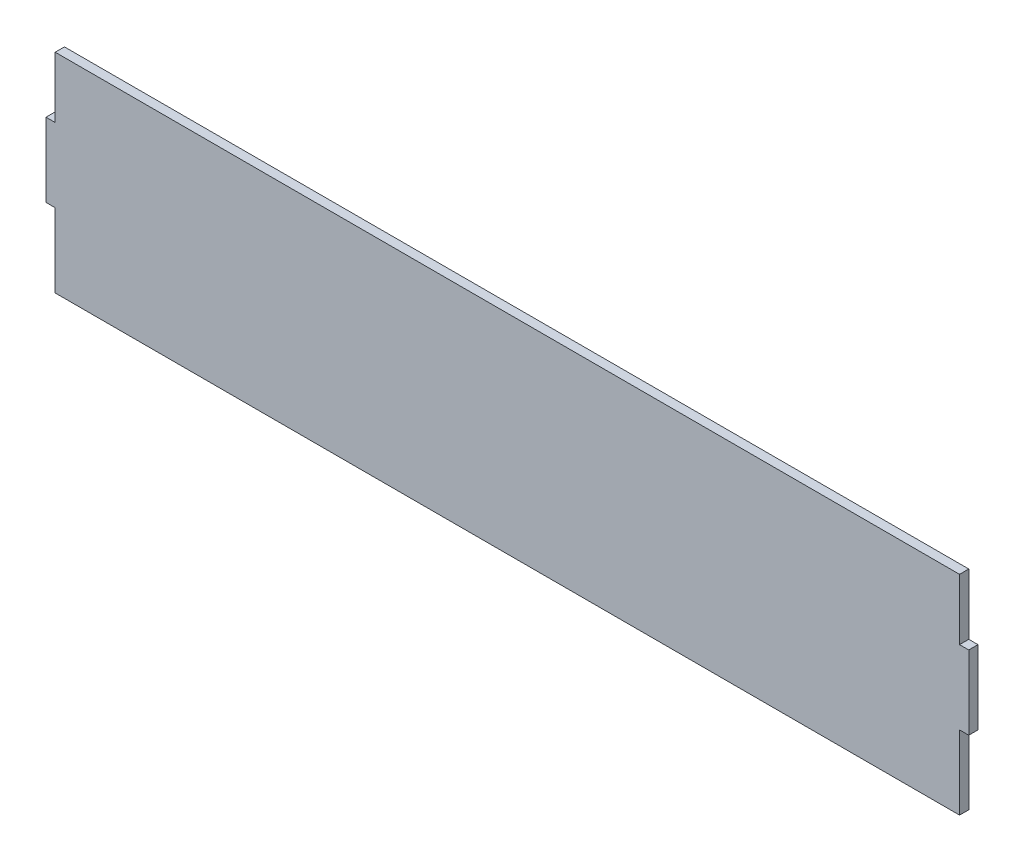
ISO-10303-21;
HEADER;
FILE_DESCRIPTION(('STEP AP214'),'2;1');
FILE_NAME('part.step','',(''),(''),'','','');
FILE_SCHEMA(('AUTOMOTIVE_DESIGN { 1 0 10303 214 1 1 1 1 }'));
ENDSEC;
DATA;
#1=APPLICATION_CONTEXT('core data for automotive mechanical design processes');
#2=APPLICATION_PROTOCOL_DEFINITION('international standard','automotive_design',2000,#1);
#3=PRODUCT_CONTEXT('',#1,'mechanical');
#4=PRODUCT('Part','Part','',(#3));
#5=PRODUCT_RELATED_PRODUCT_CATEGORY('part','',(#4));
#6=PRODUCT_DEFINITION_FORMATION('','',#4);
#7=PRODUCT_DEFINITION_CONTEXT('part definition',#1,'design');
#8=PRODUCT_DEFINITION('design','',#6,#7);
#9=PRODUCT_DEFINITION_SHAPE('','',#8);
#10=(LENGTH_UNIT() NAMED_UNIT(*) SI_UNIT(.MILLI.,.METRE.));
#11=(NAMED_UNIT(*) PLANE_ANGLE_UNIT() SI_UNIT($,.RADIAN.));
#12=(NAMED_UNIT(*) SI_UNIT($,.STERADIAN.) SOLID_ANGLE_UNIT());
#13=UNCERTAINTY_MEASURE_WITH_UNIT(LENGTH_MEASURE(1.E-05),#10,'distance_accuracy_value','');
#14=(GEOMETRIC_REPRESENTATION_CONTEXT(3) GLOBAL_UNCERTAINTY_ASSIGNED_CONTEXT((#13)) GLOBAL_UNIT_ASSIGNED_CONTEXT((#10,
#11,#12)) REPRESENTATION_CONTEXT('',''));
#15=CARTESIAN_POINT('',(0.,0.,0.));
#16=DIRECTION('',(0.,0.,1.));
#17=DIRECTION('',(1.,0.,0.));
#18=AXIS2_PLACEMENT_3D('',#15,#16,#17);
#19=CARTESIAN_POINT('',(0.,80.,5.));
#20=DIRECTION('',(0.,-1.,0.));
#21=DIRECTION('',(0.,0.,-1.));
#22=AXIS2_PLACEMENT_3D('',#19,#20,#21);
#23=PLANE('',#22);
#24=DIRECTION('',(-1.,0.,0.));
#25=VECTOR('',#24,1.);
#26=CARTESIAN_POINT('',(0.,80.,0.));
#27=LINE('',#26,#25);
#28=CARTESIAN_POINT('',(500.,80.,0.));
#29=VERTEX_POINT('',#28);
#30=CARTESIAN_POINT('',(495.,80.,0.));
#31=VERTEX_POINT('',#30);
#32=EDGE_CURVE('E158',#29,#31,#27,.T.);
#33=ORIENTED_EDGE('',*,*,#32,.T.);
#34=DIRECTION('',(0.,0.,-1.));
#35=VECTOR('',#34,1.);
#36=CARTESIAN_POINT('',(495.,80.,5.));
#37=LINE('',#36,#35);
#38=CARTESIAN_POINT('',(495.,80.,5.));
#39=VERTEX_POINT('',#38);
#40=EDGE_CURVE('E11',#39,#31,#37,.T.);
#41=ORIENTED_EDGE('',*,*,#40,.F.);
#42=DIRECTION('',(-1.,0.,0.));
#43=VECTOR('',#42,1.);
#44=CARTESIAN_POINT('',(0.,80.,5.));
#45=LINE('',#44,#43);
#46=CARTESIAN_POINT('',(500.,80.,5.));
#47=VERTEX_POINT('',#46);
#48=EDGE_CURVE('E189',#47,#39,#45,.T.);
#49=ORIENTED_EDGE('',*,*,#48,.F.);
#50=DIRECTION('',(0.,0.,-1.));
#51=VECTOR('',#50,1.);
#52=CARTESIAN_POINT('',(500.,80.,5.));
#53=LINE('',#52,#51);
#54=EDGE_CURVE('E52',#47,#29,#53,.T.);
#55=ORIENTED_EDGE('',*,*,#54,.T.);
#56=EDGE_LOOP('',(#33,#41,#49,#55));
#57=FACE_BOUND('',#56,.T.);
#58=ADVANCED_FACE('F36',(#57),#23,.F.);
#59=CARTESIAN_POINT('',(495.,0.,5.));
#60=DIRECTION('',(-1.,0.,0.));
#61=DIRECTION('',(0.,0.,1.));
#62=AXIS2_PLACEMENT_3D('',#59,#60,#61);
#63=PLANE('',#62);
#64=DIRECTION('',(0.,1.,0.));
#65=VECTOR('',#64,1.);
#66=CARTESIAN_POINT('',(495.,0.,0.));
#67=LINE('',#66,#65);
#68=CARTESIAN_POINT('',(495.,113.,0.));
#69=VERTEX_POINT('',#68);
#70=EDGE_CURVE('E160',#31,#69,#67,.T.);
#71=ORIENTED_EDGE('',*,*,#70,.T.);
#72=DIRECTION('',(0.,0.,-1.));
#73=VECTOR('',#72,1.);
#74=CARTESIAN_POINT('',(495.,113.,5.));
#75=LINE('',#74,#73);
#76=CARTESIAN_POINT('',(495.,113.,5.));
#77=VERTEX_POINT('',#76);
#78=EDGE_CURVE('E44',#77,#69,#75,.T.);
#79=ORIENTED_EDGE('',*,*,#78,.F.);
#80=DIRECTION('',(0.,1.,0.));
#81=VECTOR('',#80,1.);
#82=CARTESIAN_POINT('',(495.,0.,5.));
#83=LINE('',#82,#81);
#84=EDGE_CURVE('E103',#39,#77,#83,.T.);
#85=ORIENTED_EDGE('',*,*,#84,.F.);
#86=ORIENTED_EDGE('',*,*,#40,.T.);
#87=EDGE_LOOP('',(#71,#79,#85,#86));
#88=FACE_BOUND('',#87,.T.);
#89=ADVANCED_FACE('F210',(#88),#63,.F.);
#90=CARTESIAN_POINT('',(0.,113.,5.));
#91=DIRECTION('',(0.,1.,0.));
#92=DIRECTION('',(0.,0.,1.));
#93=AXIS2_PLACEMENT_3D('',#90,#91,#92);
#94=PLANE('',#93);
#95=DIRECTION('',(1.,0.,0.));
#96=VECTOR('',#95,1.);
#97=CARTESIAN_POINT('',(0.,113.,0.));
#98=LINE('',#97,#96);
#99=CARTESIAN_POINT('',(5.,113.,0.));
#100=VERTEX_POINT('',#99);
#101=EDGE_CURVE('E163',#100,#69,#98,.T.);
#102=ORIENTED_EDGE('',*,*,#101,.F.);
#103=DIRECTION('',(0.,0.,-1.));
#104=VECTOR('',#103,1.);
#105=CARTESIAN_POINT('',(5.,113.,5.));
#106=LINE('',#105,#104);
#107=CARTESIAN_POINT('',(5.,113.,5.));
#108=VERTEX_POINT('',#107);
#109=EDGE_CURVE('E203',#108,#100,#106,.T.);
#110=ORIENTED_EDGE('',*,*,#109,.F.);
#111=DIRECTION('',(1.,0.,0.));
#112=VECTOR('',#111,1.);
#113=CARTESIAN_POINT('',(0.,113.,5.));
#114=LINE('',#113,#112);
#115=EDGE_CURVE('E209',#108,#77,#114,.T.);
#116=ORIENTED_EDGE('',*,*,#115,.T.);
#117=ORIENTED_EDGE('',*,*,#78,.T.);
#118=EDGE_LOOP('',(#102,#110,#116,#117));
#119=FACE_BOUND('',#118,.T.);
#120=ADVANCED_FACE('F207',(#119),#94,.T.);
#121=CARTESIAN_POINT('',(5.,0.,5.));
#122=DIRECTION('',(-1.,0.,0.));
#123=DIRECTION('',(0.,0.,1.));
#124=AXIS2_PLACEMENT_3D('',#121,#122,#123);
#125=PLANE('',#124);
#126=DIRECTION('',(0.,1.,0.));
#127=VECTOR('',#126,1.);
#128=CARTESIAN_POINT('',(5.,0.,0.));
#129=LINE('',#128,#127);
#130=CARTESIAN_POINT('',(5.,80.,0.));
#131=VERTEX_POINT('',#130);
#132=EDGE_CURVE('E166',#131,#100,#129,.T.);
#133=ORIENTED_EDGE('',*,*,#132,.F.);
#134=DIRECTION('',(0.,0.,-1.));
#135=VECTOR('',#134,1.);
#136=CARTESIAN_POINT('',(5.,80.,5.));
#137=LINE('',#136,#135);
#138=CARTESIAN_POINT('',(5.,80.,5.));
#139=VERTEX_POINT('',#138);
#140=EDGE_CURVE('E201',#139,#131,#137,.T.);
#141=ORIENTED_EDGE('',*,*,#140,.F.);
#142=DIRECTION('',(0.,1.,0.));
#143=VECTOR('',#142,1.);
#144=CARTESIAN_POINT('',(5.,0.,5.));
#145=LINE('',#144,#143);
#146=EDGE_CURVE('E220',#139,#108,#145,.T.);
#147=ORIENTED_EDGE('',*,*,#146,.T.);
#148=ORIENTED_EDGE('',*,*,#109,.T.);
#149=EDGE_LOOP('',(#133,#141,#147,#148));
#150=FACE_BOUND('',#149,.T.);
#151=ADVANCED_FACE('F217',(#150),#125,.T.);
#152=CARTESIAN_POINT('',(0.,80.,5.));
#153=DIRECTION('',(0.,1.,0.));
#154=DIRECTION('',(0.,0.,1.));
#155=AXIS2_PLACEMENT_3D('',#152,#153,#154);
#156=PLANE('',#155);
#157=DIRECTION('',(1.,0.,0.));
#158=VECTOR('',#157,1.);
#159=CARTESIAN_POINT('',(0.,80.,0.));
#160=LINE('',#159,#158);
#161=CARTESIAN_POINT('',(0.,80.,0.));
#162=VERTEX_POINT('',#161);
#163=EDGE_CURVE('E169',#162,#131,#160,.T.);
#164=ORIENTED_EDGE('',*,*,#163,.F.);
#165=DIRECTION('',(0.,0.,-1.));
#166=VECTOR('',#165,1.);
#167=CARTESIAN_POINT('',(0.,80.,5.));
#168=LINE('',#167,#166);
#169=CARTESIAN_POINT('',(0.,80.,5.));
#170=VERTEX_POINT('',#169);
#171=EDGE_CURVE('E199',#170,#162,#168,.T.);
#172=ORIENTED_EDGE('',*,*,#171,.F.);
#173=DIRECTION('',(1.,0.,0.));
#174=VECTOR('',#173,1.);
#175=CARTESIAN_POINT('',(0.,80.,5.));
#176=LINE('',#175,#174);
#177=EDGE_CURVE('E224',#170,#139,#176,.T.);
#178=ORIENTED_EDGE('',*,*,#177,.T.);
#179=ORIENTED_EDGE('',*,*,#140,.T.);
#180=EDGE_LOOP('',(#164,#172,#178,#179));
#181=FACE_BOUND('',#180,.T.);
#182=ADVANCED_FACE('F323',(#181),#156,.T.);
#183=CARTESIAN_POINT('',(0.,0.,5.));
#184=DIRECTION('',(-1.,0.,0.));
#185=DIRECTION('',(0.,0.,1.));
#186=AXIS2_PLACEMENT_3D('',#183,#184,#185);
#187=PLANE('',#186);
#188=DIRECTION('',(0.,1.,0.));
#189=VECTOR('',#188,1.);
#190=CARTESIAN_POINT('',(0.,0.,0.));
#191=LINE('',#190,#189);
#192=CARTESIAN_POINT('',(0.,40.,0.));
#193=VERTEX_POINT('',#192);
#194=EDGE_CURVE('E172',#193,#162,#191,.T.);
#195=ORIENTED_EDGE('',*,*,#194,.F.);
#196=DIRECTION('',(0.,0.,-1.));
#197=VECTOR('',#196,1.);
#198=CARTESIAN_POINT('',(0.,40.,5.));
#199=LINE('',#198,#197);
#200=CARTESIAN_POINT('',(0.,40.,5.));
#201=VERTEX_POINT('',#200);
#202=EDGE_CURVE('E197',#201,#193,#199,.T.);
#203=ORIENTED_EDGE('',*,*,#202,.F.);
#204=DIRECTION('',(0.,1.,0.));
#205=VECTOR('',#204,1.);
#206=CARTESIAN_POINT('',(0.,0.,5.));
#207=LINE('',#206,#205);
#208=EDGE_CURVE('E230',#201,#170,#207,.T.);
#209=ORIENTED_EDGE('',*,*,#208,.T.);
#210=ORIENTED_EDGE('',*,*,#171,.T.);
#211=EDGE_LOOP('',(#195,#203,#209,#210));
#212=FACE_BOUND('',#211,.T.);
#213=ADVANCED_FACE('F314',(#212),#187,.T.);
#214=CARTESIAN_POINT('',(0.,40.,5.));
#215=DIRECTION('',(0.,-1.,0.));
#216=DIRECTION('',(0.,0.,-1.));
#217=AXIS2_PLACEMENT_3D('',#214,#215,#216);
#218=PLANE('',#217);
#219=DIRECTION('',(-1.,0.,0.));
#220=VECTOR('',#219,1.);
#221=CARTESIAN_POINT('',(0.,40.,0.));
#222=LINE('',#221,#220);
#223=CARTESIAN_POINT('',(5.,40.,0.));
#224=VERTEX_POINT('',#223);
#225=EDGE_CURVE('E175',#224,#193,#222,.T.);
#226=ORIENTED_EDGE('',*,*,#225,.F.);
#227=DIRECTION('',(0.,0.,-1.));
#228=VECTOR('',#227,1.);
#229=CARTESIAN_POINT('',(5.,40.,5.));
#230=LINE('',#229,#228);
#231=CARTESIAN_POINT('',(5.,40.,5.));
#232=VERTEX_POINT('',#231);
#233=EDGE_CURVE('E195',#232,#224,#230,.T.);
#234=ORIENTED_EDGE('',*,*,#233,.F.);
#235=DIRECTION('',(-1.,0.,0.));
#236=VECTOR('',#235,1.);
#237=CARTESIAN_POINT('',(0.,40.,5.));
#238=LINE('',#237,#236);
#239=EDGE_CURVE('E233',#232,#201,#238,.T.);
#240=ORIENTED_EDGE('',*,*,#239,.T.);
#241=ORIENTED_EDGE('',*,*,#202,.T.);
#242=EDGE_LOOP('',(#226,#234,#240,#241));
#243=FACE_BOUND('',#242,.T.);
#244=ADVANCED_FACE('F245',(#243),#218,.T.);
#245=CARTESIAN_POINT('',(5.,0.,5.));
#246=DIRECTION('',(-1.,0.,0.));
#247=DIRECTION('',(0.,0.,1.));
#248=AXIS2_PLACEMENT_3D('',#245,#246,#247);
#249=PLANE('',#248);
#250=DIRECTION('',(0.,1.,0.));
#251=VECTOR('',#250,1.);
#252=CARTESIAN_POINT('',(5.,0.,0.));
#253=LINE('',#252,#251);
#254=CARTESIAN_POINT('',(5.,0.,0.));
#255=VERTEX_POINT('',#254);
#256=EDGE_CURVE('E178',#255,#224,#253,.T.);
#257=ORIENTED_EDGE('',*,*,#256,.F.);
#258=DIRECTION('',(0.,0.,-1.));
#259=VECTOR('',#258,1.);
#260=CARTESIAN_POINT('',(5.,0.,5.));
#261=LINE('',#260,#259);
#262=CARTESIAN_POINT('',(5.,0.,5.));
#263=VERTEX_POINT('',#262);
#264=EDGE_CURVE('E193',#263,#255,#261,.T.);
#265=ORIENTED_EDGE('',*,*,#264,.F.);
#266=DIRECTION('',(0.,1.,0.));
#267=VECTOR('',#266,1.);
#268=CARTESIAN_POINT('',(5.,0.,5.));
#269=LINE('',#268,#267);
#270=EDGE_CURVE('E236',#263,#232,#269,.T.);
#271=ORIENTED_EDGE('',*,*,#270,.T.);
#272=ORIENTED_EDGE('',*,*,#233,.T.);
#273=EDGE_LOOP('',(#257,#265,#271,#272));
#274=FACE_BOUND('',#273,.T.);
#275=ADVANCED_FACE('F240',(#274),#249,.T.);
#276=CARTESIAN_POINT('',(0.,0.,5.));
#277=DIRECTION('',(0.,1.,0.));
#278=DIRECTION('',(0.,0.,1.));
#279=AXIS2_PLACEMENT_3D('',#276,#277,#278);
#280=PLANE('',#279);
#281=DIRECTION('',(1.,0.,0.));
#282=VECTOR('',#281,1.);
#283=CARTESIAN_POINT('',(0.,0.,0.));
#284=LINE('',#283,#282);
#285=CARTESIAN_POINT('',(495.,0.,0.));
#286=VERTEX_POINT('',#285);
#287=EDGE_CURVE('E181',#255,#286,#284,.T.);
#288=ORIENTED_EDGE('',*,*,#287,.T.);
#289=DIRECTION('',(0.,0.,-1.));
#290=VECTOR('',#289,1.);
#291=CARTESIAN_POINT('',(495.,0.,5.));
#292=LINE('',#291,#290);
#293=CARTESIAN_POINT('',(495.,0.,5.));
#294=VERTEX_POINT('',#293);
#295=EDGE_CURVE('E150',#294,#286,#292,.T.);
#296=ORIENTED_EDGE('',*,*,#295,.F.);
#297=DIRECTION('',(1.,0.,0.));
#298=VECTOR('',#297,1.);
#299=CARTESIAN_POINT('',(0.,0.,5.));
#300=LINE('',#299,#298);
#301=EDGE_CURVE('E138',#263,#294,#300,.T.);
#302=ORIENTED_EDGE('',*,*,#301,.F.);
#303=ORIENTED_EDGE('',*,*,#264,.T.);
#304=EDGE_LOOP('',(#288,#296,#302,#303));
#305=FACE_BOUND('',#304,.T.);
#306=ADVANCED_FACE('F249',(#305),#280,.F.);
#307=CARTESIAN_POINT('',(495.,0.,5.));
#308=DIRECTION('',(-1.,0.,0.));
#309=DIRECTION('',(0.,0.,1.));
#310=AXIS2_PLACEMENT_3D('',#307,#308,#309);
#311=PLANE('',#310);
#312=DIRECTION('',(0.,1.,0.));
#313=VECTOR('',#312,1.);
#314=CARTESIAN_POINT('',(495.,0.,0.));
#315=LINE('',#314,#313);
#316=CARTESIAN_POINT('',(495.,40.,0.));
#317=VERTEX_POINT('',#316);
#318=EDGE_CURVE('E147',#286,#317,#315,.T.);
#319=ORIENTED_EDGE('',*,*,#318,.T.);
#320=DIRECTION('',(0.,0.,-1.));
#321=VECTOR('',#320,1.);
#322=CARTESIAN_POINT('',(495.,40.,5.));
#323=LINE('',#322,#321);
#324=CARTESIAN_POINT('',(495.,40.,5.));
#325=VERTEX_POINT('',#324);
#326=EDGE_CURVE('E144',#325,#317,#323,.T.);
#327=ORIENTED_EDGE('',*,*,#326,.F.);
#328=DIRECTION('',(0.,1.,0.));
#329=VECTOR('',#328,1.);
#330=CARTESIAN_POINT('',(495.,0.,5.));
#331=LINE('',#330,#329);
#332=EDGE_CURVE('E130',#294,#325,#331,.T.);
#333=ORIENTED_EDGE('',*,*,#332,.F.);
#334=ORIENTED_EDGE('',*,*,#295,.T.);
#335=EDGE_LOOP('',(#319,#327,#333,#334));
#336=FACE_BOUND('',#335,.T.);
#337=ADVANCED_FACE('F145',(#336),#311,.F.);
#338=CARTESIAN_POINT('',(0.,40.,5.));
#339=DIRECTION('',(0.,1.,0.));
#340=DIRECTION('',(0.,0.,1.));
#341=AXIS2_PLACEMENT_3D('',#338,#339,#340);
#342=PLANE('',#341);
#343=DIRECTION('',(1.,0.,0.));
#344=VECTOR('',#343,1.);
#345=CARTESIAN_POINT('',(0.,40.,0.));
#346=LINE('',#345,#344);
#347=CARTESIAN_POINT('',(500.,40.,0.));
#348=VERTEX_POINT('',#347);
#349=EDGE_CURVE('E184',#317,#348,#346,.T.);
#350=ORIENTED_EDGE('',*,*,#349,.T.);
#351=DIRECTION('',(0.,0.,-1.));
#352=VECTOR('',#351,1.);
#353=CARTESIAN_POINT('',(500.,40.,5.));
#354=LINE('',#353,#352);
#355=CARTESIAN_POINT('',(500.,40.,5.));
#356=VERTEX_POINT('',#355);
#357=EDGE_CURVE('E91',#356,#348,#354,.T.);
#358=ORIENTED_EDGE('',*,*,#357,.F.);
#359=DIRECTION('',(1.,0.,0.));
#360=VECTOR('',#359,1.);
#361=CARTESIAN_POINT('',(0.,40.,5.));
#362=LINE('',#361,#360);
#363=EDGE_CURVE('E135',#325,#356,#362,.T.);
#364=ORIENTED_EDGE('',*,*,#363,.F.);
#365=ORIENTED_EDGE('',*,*,#326,.T.);
#366=EDGE_LOOP('',(#350,#358,#364,#365));
#367=FACE_BOUND('',#366,.T.);
#368=ADVANCED_FACE('F152',(#367),#342,.F.);
#369=CARTESIAN_POINT('',(500.,0.,5.));
#370=DIRECTION('',(1.,0.,0.));
#371=DIRECTION('',(0.,0.,-1.));
#372=AXIS2_PLACEMENT_3D('',#369,#370,#371);
#373=PLANE('',#372);
#374=DIRECTION('',(0.,-1.,0.));
#375=VECTOR('',#374,1.);
#376=CARTESIAN_POINT('',(500.,0.,0.));
#377=LINE('',#376,#375);
#378=EDGE_CURVE('E186',#29,#348,#377,.T.);
#379=ORIENTED_EDGE('',*,*,#378,.F.);
#380=ORIENTED_EDGE('',*,*,#54,.F.);
#381=DIRECTION('',(0.,-1.,0.));
#382=VECTOR('',#381,1.);
#383=CARTESIAN_POINT('',(500.,0.,5.));
#384=LINE('',#383,#382);
#385=EDGE_CURVE('E153',#47,#356,#384,.T.);
#386=ORIENTED_EDGE('',*,*,#385,.T.);
#387=ORIENTED_EDGE('',*,*,#357,.T.);
#388=EDGE_LOOP('',(#379,#380,#386,#387));
#389=FACE_BOUND('',#388,.T.);
#390=ADVANCED_FACE('F262',(#389),#373,.T.);
#391=CARTESIAN_POINT('',(0.,0.,5.));
#392=DIRECTION('',(0.,0.,1.));
#393=DIRECTION('',(1.,0.,0.));
#394=AXIS2_PLACEMENT_3D('',#391,#392,#393);
#395=PLANE('',#394);
#396=ORIENTED_EDGE('',*,*,#48,.T.);
#397=ORIENTED_EDGE('',*,*,#84,.T.);
#398=ORIENTED_EDGE('',*,*,#115,.F.);
#399=ORIENTED_EDGE('',*,*,#146,.F.);
#400=ORIENTED_EDGE('',*,*,#177,.F.);
#401=ORIENTED_EDGE('',*,*,#208,.F.);
#402=ORIENTED_EDGE('',*,*,#239,.F.);
#403=ORIENTED_EDGE('',*,*,#270,.F.);
#404=ORIENTED_EDGE('',*,*,#301,.T.);
#405=ORIENTED_EDGE('',*,*,#332,.T.);
#406=ORIENTED_EDGE('',*,*,#363,.T.);
#407=ORIENTED_EDGE('',*,*,#385,.F.);
#408=EDGE_LOOP('',(#396,#397,#398,#399,#400,#401,#402,#403,#404,#405,#406,#407));
#409=FACE_BOUND('',#408,.T.);
#410=ADVANCED_FACE('F132',(#409),#395,.T.);
#411=CARTESIAN_POINT('',(0.,0.,0.));
#412=DIRECTION('',(0.,0.,1.));
#413=DIRECTION('',(1.,0.,0.));
#414=AXIS2_PLACEMENT_3D('',#411,#412,#413);
#415=PLANE('',#414);
#416=ORIENTED_EDGE('',*,*,#32,.F.);
#417=ORIENTED_EDGE('',*,*,#378,.T.);
#418=ORIENTED_EDGE('',*,*,#349,.F.);
#419=ORIENTED_EDGE('',*,*,#318,.F.);
#420=ORIENTED_EDGE('',*,*,#287,.F.);
#421=ORIENTED_EDGE('',*,*,#256,.T.);
#422=ORIENTED_EDGE('',*,*,#225,.T.);
#423=ORIENTED_EDGE('',*,*,#194,.T.);
#424=ORIENTED_EDGE('',*,*,#163,.T.);
#425=ORIENTED_EDGE('',*,*,#132,.T.);
#426=ORIENTED_EDGE('',*,*,#101,.T.);
#427=ORIENTED_EDGE('',*,*,#70,.F.);
#428=EDGE_LOOP('',(#416,#417,#418,#419,#420,#421,#422,#423,#424,#425,#426,#427));
#429=FACE_BOUND('',#428,.T.);
#430=ADVANCED_FACE('F213',(#429),#415,.F.);
#431=CLOSED_SHELL('',(#58,#89,#120,#151,#182,#213,#244,#275,#306,#337,#368,#390,#410,#430));
#432=MANIFOLD_SOLID_BREP('B2',#431);
#433=ADVANCED_BREP_SHAPE_REPRESENTATION('',(#18,#432),#14);
#434=SHAPE_DEFINITION_REPRESENTATION(#9,#433);
ENDSEC;
END-ISO-10303-21;
